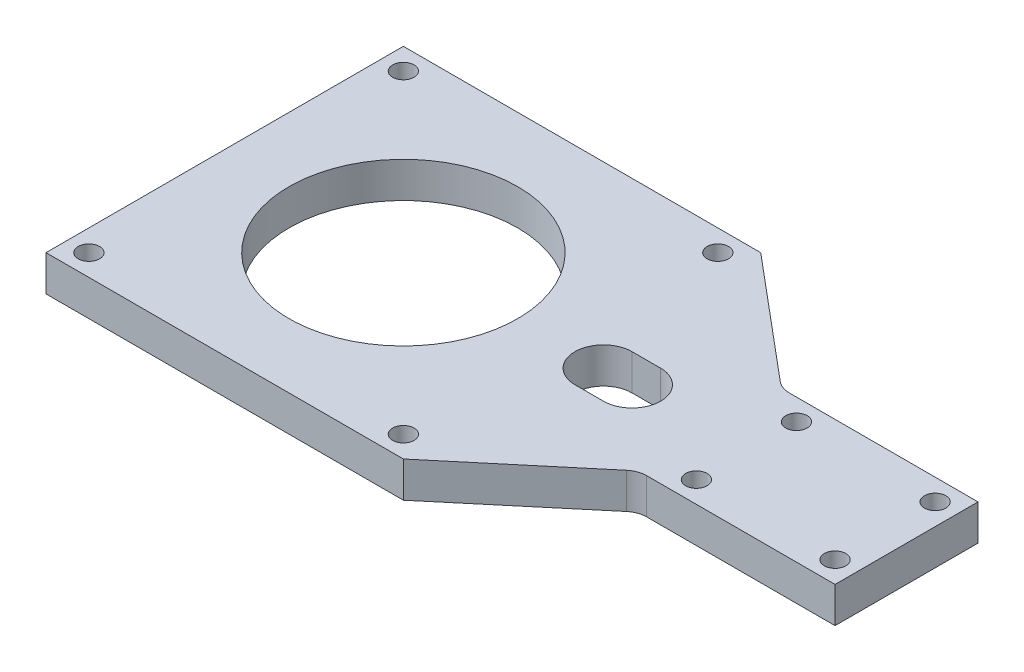
ISO-10303-21;
HEADER;
FILE_DESCRIPTION(('STEP AP214'),'2;1');
FILE_NAME('part.step','',(''),(''),'','','');
FILE_SCHEMA(('AUTOMOTIVE_DESIGN { 1 0 10303 214 1 1 1 1 }'));
ENDSEC;
DATA;
#1=APPLICATION_CONTEXT('core data for automotive mechanical design processes');
#2=APPLICATION_PROTOCOL_DEFINITION('international standard','automotive_design',2000,#1);
#3=PRODUCT_CONTEXT('',#1,'mechanical');
#4=PRODUCT('Part','Part','',(#3));
#5=PRODUCT_RELATED_PRODUCT_CATEGORY('part','',(#4));
#6=PRODUCT_DEFINITION_FORMATION('','',#4);
#7=PRODUCT_DEFINITION_CONTEXT('part definition',#1,'design');
#8=PRODUCT_DEFINITION('design','',#6,#7);
#9=PRODUCT_DEFINITION_SHAPE('','',#8);
#10=(LENGTH_UNIT() NAMED_UNIT(*) SI_UNIT(.MILLI.,.METRE.));
#11=(NAMED_UNIT(*) PLANE_ANGLE_UNIT() SI_UNIT($,.RADIAN.));
#12=(NAMED_UNIT(*) SI_UNIT($,.STERADIAN.) SOLID_ANGLE_UNIT());
#13=UNCERTAINTY_MEASURE_WITH_UNIT(LENGTH_MEASURE(1.E-05),#10,'distance_accuracy_value','');
#14=(GEOMETRIC_REPRESENTATION_CONTEXT(3) GLOBAL_UNCERTAINTY_ASSIGNED_CONTEXT((#13)) GLOBAL_UNIT_ASSIGNED_CONTEXT((#10,
#11,#12)) REPRESENTATION_CONTEXT('',''));
#15=CARTESIAN_POINT('',(0.,0.,0.));
#16=DIRECTION('',(0.,0.,1.));
#17=DIRECTION('',(1.,0.,0.));
#18=AXIS2_PLACEMENT_3D('',#15,#16,#17);
#19=CARTESIAN_POINT('',(15.6554577499628,-35.,0.));
#20=DIRECTION('',(0.,-1.,0.));
#21=DIRECTION('',(1.,0.,0.));
#22=AXIS2_PLACEMENT_3D('',#19,#20,#21);
#23=PLANE('',#22);
#24=CARTESIAN_POINT('',(67.4,-35.,7.));
#25=DIRECTION('',(0.,1.,0.));
#26=DIRECTION('',(0.,0.,1.));
#27=AXIS2_PLACEMENT_3D('',#24,#25,#26);
#28=CIRCLE('',#27,1.5);
#29=CARTESIAN_POINT('',(67.4,-35.,8.5));
#30=VERTEX_POINT('',#29);
#31=EDGE_CURVE('E388',#30,#30,#28,.T.);
#32=ORIENTED_EDGE('',*,*,#31,.F.);
#33=EDGE_LOOP('',(#32));
#34=FACE_BOUND('',#33,.T.);
#35=CARTESIAN_POINT('',(48.,-35.,-7.));
#36=DIRECTION('',(0.,1.,0.));
#37=DIRECTION('',(0.,0.,1.));
#38=AXIS2_PLACEMENT_3D('',#35,#36,#37);
#39=CIRCLE('',#38,1.5);
#40=CARTESIAN_POINT('',(48.,-35.,-5.5));
#41=VERTEX_POINT('',#40);
#42=EDGE_CURVE('E393',#41,#41,#39,.T.);
#43=ORIENTED_EDGE('',*,*,#42,.F.);
#44=EDGE_LOOP('',(#43));
#45=FACE_BOUND('',#44,.T.);
#46=CARTESIAN_POINT('',(67.4,-35.,-7.));
#47=DIRECTION('',(0.,1.,0.));
#48=DIRECTION('',(0.,0.,1.));
#49=AXIS2_PLACEMENT_3D('',#46,#47,#48);
#50=CIRCLE('',#49,1.5);
#51=CARTESIAN_POINT('',(67.4,-35.,-5.5));
#52=VERTEX_POINT('',#51);
#53=EDGE_CURVE('E398',#52,#52,#50,.T.);
#54=ORIENTED_EDGE('',*,*,#53,.F.);
#55=EDGE_LOOP('',(#54));
#56=FACE_BOUND('',#55,.T.);
#57=CARTESIAN_POINT('',(48.,-35.,7.));
#58=DIRECTION('',(0.,1.,0.));
#59=DIRECTION('',(0.,0.,1.));
#60=AXIS2_PLACEMENT_3D('',#57,#58,#59);
#61=CIRCLE('',#60,1.5);
#62=CARTESIAN_POINT('',(48.,-35.,8.5));
#63=VERTEX_POINT('',#62);
#64=EDGE_CURVE('E351',#63,#63,#61,.T.);
#65=ORIENTED_EDGE('',*,*,#64,.F.);
#66=EDGE_LOOP('',(#65));
#67=FACE_BOUND('',#66,.T.);
#68=DIRECTION('',(-1.,0.,0.));
#69=VECTOR('',#68,1.);
#70=CARTESIAN_POINT('',(15.6554577499628,-35.,-4.));
#71=LINE('',#70,#69);
#72=CARTESIAN_POINT('',(32.,-35.,-4.));
#73=VERTEX_POINT('',#72);
#74=CARTESIAN_POINT('',(28.,-35.,-4.));
#75=VERTEX_POINT('',#74);
#76=EDGE_CURVE('E201',#73,#75,#71,.T.);
#77=ORIENTED_EDGE('',*,*,#76,.F.);
#78=CARTESIAN_POINT('',(32.,-35.,0.));
#79=DIRECTION('',(0.,-1.,0.));
#80=DIRECTION('',(0.,0.,-1.));
#81=AXIS2_PLACEMENT_3D('',#78,#79,#80);
#82=CIRCLE('',#81,4.);
#83=CARTESIAN_POINT('',(32.,-35.,4.));
#84=VERTEX_POINT('',#83);
#85=EDGE_CURVE('E161',#84,#73,#82,.F.);
#86=ORIENTED_EDGE('',*,*,#85,.F.);
#87=DIRECTION('',(-1.,0.,0.));
#88=VECTOR('',#87,1.);
#89=CARTESIAN_POINT('',(15.6554577499628,-35.,4.));
#90=LINE('',#89,#88);
#91=CARTESIAN_POINT('',(28.,-35.,4.));
#92=VERTEX_POINT('',#91);
#93=EDGE_CURVE('E195',#84,#92,#90,.T.);
#94=ORIENTED_EDGE('',*,*,#93,.T.);
#95=CARTESIAN_POINT('',(28.,-35.,0.));
#96=DIRECTION('',(0.,-1.,0.));
#97=DIRECTION('',(0.,0.,-1.));
#98=AXIS2_PLACEMENT_3D('',#95,#96,#97);
#99=CIRCLE('',#98,4.);
#100=EDGE_CURVE('E165',#75,#92,#99,.F.);
#101=ORIENTED_EDGE('',*,*,#100,.F.);
#102=EDGE_LOOP('',(#77,#86,#94,#101));
#103=FACE_BOUND('',#102,.T.);
#104=CARTESIAN_POINT('',(22.,-35.,22.));
#105=DIRECTION('',(0.,1.,0.));
#106=DIRECTION('',(0.,0.,-1.));
#107=AXIS2_PLACEMENT_3D('',#104,#105,#106);
#108=CIRCLE('',#107,1.5);
#109=CARTESIAN_POINT('',(22.,-35.,20.5));
#110=VERTEX_POINT('',#109);
#111=EDGE_CURVE('E247',#110,#110,#108,.T.);
#112=ORIENTED_EDGE('',*,*,#111,.F.);
#113=EDGE_LOOP('',(#112));
#114=FACE_BOUND('',#113,.T.);
#115=CARTESIAN_POINT('',(0.,-35.,0.));
#116=DIRECTION('',(0.,-1.,0.));
#117=DIRECTION('',(0.,0.,-1.));
#118=AXIS2_PLACEMENT_3D('',#115,#116,#117);
#119=CIRCLE('',#118,16.);
#120=CARTESIAN_POINT('',(0.,-35.,-16.));
#121=VERTEX_POINT('',#120);
#122=EDGE_CURVE('E251',#121,#121,#119,.T.);
#123=ORIENTED_EDGE('',*,*,#122,.T.);
#124=EDGE_LOOP('',(#123));
#125=FACE_BOUND('',#124,.T.);
#126=CARTESIAN_POINT('',(22.,-35.,-22.));
#127=DIRECTION('',(0.,-1.,0.));
#128=DIRECTION('',(0.,0.,-1.));
#129=AXIS2_PLACEMENT_3D('',#126,#127,#128);
#130=CIRCLE('',#129,1.5);
#131=CARTESIAN_POINT('',(22.,-35.,-23.5));
#132=VERTEX_POINT('',#131);
#133=EDGE_CURVE('E256',#132,#132,#130,.T.);
#134=ORIENTED_EDGE('',*,*,#133,.T.);
#135=EDGE_LOOP('',(#134));
#136=FACE_BOUND('',#135,.T.);
#137=CARTESIAN_POINT('',(-22.,-35.,-22.));
#138=DIRECTION('',(0.,1.,0.));
#139=DIRECTION('',(0.,0.,-1.));
#140=AXIS2_PLACEMENT_3D('',#137,#138,#139);
#141=CIRCLE('',#140,1.5);
#142=CARTESIAN_POINT('',(-22.,-35.,-23.5));
#143=VERTEX_POINT('',#142);
#144=EDGE_CURVE('E260',#143,#143,#141,.T.);
#145=ORIENTED_EDGE('',*,*,#144,.F.);
#146=EDGE_LOOP('',(#145));
#147=FACE_BOUND('',#146,.T.);
#148=CARTESIAN_POINT('',(-22.,-35.,22.));
#149=DIRECTION('',(0.,-1.,0.));
#150=DIRECTION('',(0.,0.,-1.));
#151=AXIS2_PLACEMENT_3D('',#148,#149,#150);
#152=CIRCLE('',#151,1.5);
#153=CARTESIAN_POINT('',(-22.,-35.,20.5));
#154=VERTEX_POINT('',#153);
#155=EDGE_CURVE('E264',#154,#154,#152,.T.);
#156=ORIENTED_EDGE('',*,*,#155,.T.);
#157=EDGE_LOOP('',(#156));
#158=FACE_BOUND('',#157,.T.);
#159=DIRECTION('',(-1.,0.,0.));
#160=VECTOR('',#159,1.);
#161=CARTESIAN_POINT('',(0.,-35.,25.));
#162=LINE('',#161,#160);
#163=CARTESIAN_POINT('',(25.,-35.,25.));
#164=VERTEX_POINT('',#163);
#165=CARTESIAN_POINT('',(-25.,-35.,25.));
#166=VERTEX_POINT('',#165);
#167=EDGE_CURVE('E268',#164,#166,#162,.T.);
#168=ORIENTED_EDGE('',*,*,#167,.F.);
#169=DIRECTION('',(-0.766044443118978,0.,0.642787609686539));
#170=VECTOR('',#169,1.);
#171=CARTESIAN_POINT('',(33.9381519444566,-35.,17.5));
#172=LINE('',#171,#170);
#173=CARTESIAN_POINT('',(41.9910587219536,-35.,10.7428088930972));
#174=VERTEX_POINT('',#173);
#175=EDGE_CURVE('E243',#174,#164,#172,.T.);
#176=ORIENTED_EDGE('',*,*,#175,.F.);
#177=CARTESIAN_POINT('',(44.0319093827083,-35.,13.175));
#178=DIRECTION('',(0.,-1.,0.));
#179=DIRECTION('',(0.,0.,-1.));
#180=AXIS2_PLACEMENT_3D('',#177,#178,#179);
#181=CIRCLE('',#180,3.175);
#182=CARTESIAN_POINT('',(44.0319093827083,-35.,10.));
#183=VERTEX_POINT('',#182);
#184=EDGE_CURVE('E11',#174,#183,#181,.T.);
#185=ORIENTED_EDGE('',*,*,#184,.T.);
#186=DIRECTION('',(-1.,0.,0.));
#187=VECTOR('',#186,1.);
#188=CARTESIAN_POINT('',(56.6381519444566,-35.,10.));
#189=LINE('',#188,#187);
#190=CARTESIAN_POINT('',(70.4,-35.,10.));
#191=VERTEX_POINT('',#190);
#192=EDGE_CURVE('E229',#191,#183,#189,.T.);
#193=ORIENTED_EDGE('',*,*,#192,.F.);
#194=DIRECTION('',(0.,0.,1.));
#195=VECTOR('',#194,1.);
#196=CARTESIAN_POINT('',(70.4,-35.,0.));
#197=LINE('',#196,#195);
#198=CARTESIAN_POINT('',(70.4,-35.,-10.));
#199=VERTEX_POINT('',#198);
#200=EDGE_CURVE('E233',#199,#191,#197,.T.);
#201=ORIENTED_EDGE('',*,*,#200,.F.);
#202=DIRECTION('',(1.,0.,0.));
#203=VECTOR('',#202,1.);
#204=CARTESIAN_POINT('',(56.6381519444566,-35.,-10.));
#205=LINE('',#204,#203);
#206=CARTESIAN_POINT('',(44.0319093827083,-35.,-10.));
#207=VERTEX_POINT('',#206);
#208=EDGE_CURVE('E236',#207,#199,#205,.T.);
#209=ORIENTED_EDGE('',*,*,#208,.F.);
#210=CARTESIAN_POINT('',(44.0319093827083,-35.,-13.175));
#211=DIRECTION('',(0.,-1.,0.));
#212=DIRECTION('',(0.,0.,-1.));
#213=AXIS2_PLACEMENT_3D('',#210,#211,#212);
#214=CIRCLE('',#213,3.175);
#215=CARTESIAN_POINT('',(41.9910587219536,-35.,-10.7428088930972));
#216=VERTEX_POINT('',#215);
#217=EDGE_CURVE('E341',#207,#216,#214,.T.);
#218=ORIENTED_EDGE('',*,*,#217,.T.);
#219=DIRECTION('',(0.766044443118978,0.,0.642787609686539));
#220=VECTOR('',#219,1.);
#221=CARTESIAN_POINT('',(33.9381519444566,-35.,-17.5));
#222=LINE('',#221,#220);
#223=CARTESIAN_POINT('',(25.,-35.,-25.));
#224=VERTEX_POINT('',#223);
#225=EDGE_CURVE('E239',#224,#216,#222,.T.);
#226=ORIENTED_EDGE('',*,*,#225,.F.);
#227=DIRECTION('',(-1.,0.,0.));
#228=VECTOR('',#227,1.);
#229=CARTESIAN_POINT('',(0.,-35.,-25.));
#230=LINE('',#229,#228);
#231=CARTESIAN_POINT('',(-25.,-35.,-25.));
#232=VERTEX_POINT('',#231);
#233=EDGE_CURVE('E276',#224,#232,#230,.T.);
#234=ORIENTED_EDGE('',*,*,#233,.T.);
#235=DIRECTION('',(0.,0.,-1.));
#236=VECTOR('',#235,1.);
#237=CARTESIAN_POINT('',(-25.,-35.,0.));
#238=LINE('',#237,#236);
#239=EDGE_CURVE('E272',#166,#232,#238,.T.);
#240=ORIENTED_EDGE('',*,*,#239,.F.);
#241=EDGE_LOOP('',(#168,#176,#185,#193,#201,#209,#218,#226,#234,#240));
#242=FACE_BOUND('',#241,.T.);
#243=ADVANCED_FACE('F17',(#34,#45,#56,#67,#103,#114,#125,#136,#147,#158,#242),#23,.F.);
#244=CARTESIAN_POINT('',(15.6554577499628,-40.,0.));
#245=DIRECTION('',(0.,-1.,0.));
#246=DIRECTION('',(1.,0.,0.));
#247=AXIS2_PLACEMENT_3D('',#244,#245,#246);
#248=PLANE('',#247);
#249=CARTESIAN_POINT('',(67.4,-40.,7.));
#250=DIRECTION('',(0.,-1.,0.));
#251=DIRECTION('',(0.,0.,-1.));
#252=AXIS2_PLACEMENT_3D('',#249,#250,#251);
#253=CIRCLE('',#252,1.5);
#254=CARTESIAN_POINT('',(67.4,-40.,5.5));
#255=VERTEX_POINT('',#254);
#256=EDGE_CURVE('E21',#255,#255,#253,.T.);
#257=ORIENTED_EDGE('',*,*,#256,.F.);
#258=EDGE_LOOP('',(#257));
#259=FACE_BOUND('',#258,.T.);
#260=CARTESIAN_POINT('',(48.,-40.,-7.));
#261=DIRECTION('',(0.,-1.,0.));
#262=DIRECTION('',(0.,0.,-1.));
#263=AXIS2_PLACEMENT_3D('',#260,#261,#262);
#264=CIRCLE('',#263,1.5);
#265=CARTESIAN_POINT('',(48.,-40.,-8.5));
#266=VERTEX_POINT('',#265);
#267=EDGE_CURVE('E354',#266,#266,#264,.T.);
#268=ORIENTED_EDGE('',*,*,#267,.F.);
#269=EDGE_LOOP('',(#268));
#270=FACE_BOUND('',#269,.T.);
#271=CARTESIAN_POINT('',(67.4,-40.,-7.));
#272=DIRECTION('',(0.,-1.,0.));
#273=DIRECTION('',(0.,0.,-1.));
#274=AXIS2_PLACEMENT_3D('',#271,#272,#273);
#275=CIRCLE('',#274,1.5);
#276=CARTESIAN_POINT('',(67.4,-40.,-8.5));
#277=VERTEX_POINT('',#276);
#278=EDGE_CURVE('E350',#277,#277,#275,.T.);
#279=ORIENTED_EDGE('',*,*,#278,.F.);
#280=EDGE_LOOP('',(#279));
#281=FACE_BOUND('',#280,.T.);
#282=CARTESIAN_POINT('',(48.,-40.,7.));
#283=DIRECTION('',(0.,-1.,0.));
#284=DIRECTION('',(0.,0.,-1.));
#285=AXIS2_PLACEMENT_3D('',#282,#283,#284);
#286=CIRCLE('',#285,1.5);
#287=CARTESIAN_POINT('',(48.,-40.,5.5));
#288=VERTEX_POINT('',#287);
#289=EDGE_CURVE('E346',#288,#288,#286,.T.);
#290=ORIENTED_EDGE('',*,*,#289,.F.);
#291=EDGE_LOOP('',(#290));
#292=FACE_BOUND('',#291,.T.);
#293=CARTESIAN_POINT('',(32.,-40.,0.));
#294=DIRECTION('',(0.,1.,0.));
#295=DIRECTION('',(0.,0.,-1.));
#296=AXIS2_PLACEMENT_3D('',#293,#294,#295);
#297=CIRCLE('',#296,4.);
#298=CARTESIAN_POINT('',(32.,-40.,4.));
#299=VERTEX_POINT('',#298);
#300=CARTESIAN_POINT('',(32.,-40.,-4.));
#301=VERTEX_POINT('',#300);
#302=EDGE_CURVE('E159',#299,#301,#297,.T.);
#303=ORIENTED_EDGE('',*,*,#302,.T.);
#304=DIRECTION('',(-1.,0.,0.));
#305=VECTOR('',#304,1.);
#306=CARTESIAN_POINT('',(30.,-40.,-4.));
#307=LINE('',#306,#305);
#308=CARTESIAN_POINT('',(28.,-40.,-4.));
#309=VERTEX_POINT('',#308);
#310=EDGE_CURVE('E169',#301,#309,#307,.T.);
#311=ORIENTED_EDGE('',*,*,#310,.T.);
#312=CARTESIAN_POINT('',(28.,-40.,0.));
#313=DIRECTION('',(0.,1.,0.));
#314=DIRECTION('',(0.,0.,-1.));
#315=AXIS2_PLACEMENT_3D('',#312,#313,#314);
#316=CIRCLE('',#315,4.);
#317=CARTESIAN_POINT('',(28.,-40.,4.));
#318=VERTEX_POINT('',#317);
#319=EDGE_CURVE('E183',#309,#318,#316,.T.);
#320=ORIENTED_EDGE('',*,*,#319,.T.);
#321=DIRECTION('',(-1.,0.,0.));
#322=VECTOR('',#321,1.);
#323=CARTESIAN_POINT('',(30.,-40.,4.));
#324=LINE('',#323,#322);
#325=EDGE_CURVE('E52',#299,#318,#324,.T.);
#326=ORIENTED_EDGE('',*,*,#325,.F.);
#327=EDGE_LOOP('',(#303,#311,#320,#326));
#328=FACE_BOUND('',#327,.T.);
#329=CARTESIAN_POINT('',(22.,-40.,22.));
#330=DIRECTION('',(0.,1.,0.));
#331=DIRECTION('',(0.,0.,-1.));
#332=AXIS2_PLACEMENT_3D('',#329,#330,#331);
#333=CIRCLE('',#332,1.5);
#334=CARTESIAN_POINT('',(22.,-40.,20.5));
#335=VERTEX_POINT('',#334);
#336=EDGE_CURVE('E246',#335,#335,#333,.T.);
#337=ORIENTED_EDGE('',*,*,#336,.T.);
#338=EDGE_LOOP('',(#337));
#339=FACE_BOUND('',#338,.T.);
#340=CARTESIAN_POINT('',(0.,-40.,0.));
#341=DIRECTION('',(0.,-1.,0.));
#342=DIRECTION('',(0.,0.,-1.));
#343=AXIS2_PLACEMENT_3D('',#340,#341,#342);
#344=CIRCLE('',#343,16.);
#345=CARTESIAN_POINT('',(0.,-40.,-16.));
#346=VERTEX_POINT('',#345);
#347=EDGE_CURVE('E284',#346,#346,#344,.T.);
#348=ORIENTED_EDGE('',*,*,#347,.F.);
#349=EDGE_LOOP('',(#348));
#350=FACE_BOUND('',#349,.T.);
#351=CARTESIAN_POINT('',(22.,-40.,-22.));
#352=DIRECTION('',(0.,-1.,0.));
#353=DIRECTION('',(0.,0.,-1.));
#354=AXIS2_PLACEMENT_3D('',#351,#352,#353);
#355=CIRCLE('',#354,1.5);
#356=CARTESIAN_POINT('',(22.,-40.,-23.5));
#357=VERTEX_POINT('',#356);
#358=EDGE_CURVE('E288',#357,#357,#355,.T.);
#359=ORIENTED_EDGE('',*,*,#358,.F.);
#360=EDGE_LOOP('',(#359));
#361=FACE_BOUND('',#360,.T.);
#362=CARTESIAN_POINT('',(-22.,-40.,-22.));
#363=DIRECTION('',(0.,1.,0.));
#364=DIRECTION('',(0.,0.,-1.));
#365=AXIS2_PLACEMENT_3D('',#362,#363,#364);
#366=CIRCLE('',#365,1.5);
#367=CARTESIAN_POINT('',(-22.,-40.,-23.5));
#368=VERTEX_POINT('',#367);
#369=EDGE_CURVE('E292',#368,#368,#366,.T.);
#370=ORIENTED_EDGE('',*,*,#369,.T.);
#371=EDGE_LOOP('',(#370));
#372=FACE_BOUND('',#371,.T.);
#373=CARTESIAN_POINT('',(-22.,-40.,22.));
#374=DIRECTION('',(0.,-1.,0.));
#375=DIRECTION('',(0.,0.,-1.));
#376=AXIS2_PLACEMENT_3D('',#373,#374,#375);
#377=CIRCLE('',#376,1.5);
#378=CARTESIAN_POINT('',(-22.,-40.,20.5));
#379=VERTEX_POINT('',#378);
#380=EDGE_CURVE('E296',#379,#379,#377,.T.);
#381=ORIENTED_EDGE('',*,*,#380,.F.);
#382=EDGE_LOOP('',(#381));
#383=FACE_BOUND('',#382,.T.);
#384=DIRECTION('',(-1.,0.,0.));
#385=VECTOR('',#384,1.);
#386=CARTESIAN_POINT('',(0.,-40.,-25.));
#387=LINE('',#386,#385);
#388=CARTESIAN_POINT('',(25.,-40.,-25.));
#389=VERTEX_POINT('',#388);
#390=CARTESIAN_POINT('',(-25.,-40.,-25.));
#391=VERTEX_POINT('',#390);
#392=EDGE_CURVE('E252',#389,#391,#387,.T.);
#393=ORIENTED_EDGE('',*,*,#392,.F.);
#394=DIRECTION('',(-0.766044443118978,0.,-0.642787609686539));
#395=VECTOR('',#394,1.);
#396=CARTESIAN_POINT('',(33.9381519444566,-40.,-17.5));
#397=LINE('',#396,#395);
#398=CARTESIAN_POINT('',(41.9910587219536,-40.,-10.7428088930972));
#399=VERTEX_POINT('',#398);
#400=EDGE_CURVE('E208',#399,#389,#397,.T.);
#401=ORIENTED_EDGE('',*,*,#400,.F.);
#402=CARTESIAN_POINT('',(44.0319093827083,-40.,-13.175));
#403=DIRECTION('',(0.,-1.,0.));
#404=DIRECTION('',(0.,0.,-1.));
#405=AXIS2_PLACEMENT_3D('',#402,#403,#404);
#406=CIRCLE('',#405,3.175);
#407=CARTESIAN_POINT('',(44.0319093827083,-40.,-10.));
#408=VERTEX_POINT('',#407);
#409=EDGE_CURVE('E338',#399,#408,#406,.F.);
#410=ORIENTED_EDGE('',*,*,#409,.T.);
#411=DIRECTION('',(-1.,0.,0.));
#412=VECTOR('',#411,1.);
#413=CARTESIAN_POINT('',(56.6381519444566,-40.,-10.));
#414=LINE('',#413,#412);
#415=CARTESIAN_POINT('',(70.4,-40.,-10.));
#416=VERTEX_POINT('',#415);
#417=EDGE_CURVE('E211',#416,#408,#414,.T.);
#418=ORIENTED_EDGE('',*,*,#417,.F.);
#419=DIRECTION('',(0.,0.,-1.));
#420=VECTOR('',#419,1.);
#421=CARTESIAN_POINT('',(70.4,-40.,0.));
#422=LINE('',#421,#420);
#423=CARTESIAN_POINT('',(70.4,-40.,10.));
#424=VERTEX_POINT('',#423);
#425=EDGE_CURVE('E215',#424,#416,#422,.T.);
#426=ORIENTED_EDGE('',*,*,#425,.F.);
#427=DIRECTION('',(1.,0.,0.));
#428=VECTOR('',#427,1.);
#429=CARTESIAN_POINT('',(56.6381519444566,-40.,10.));
#430=LINE('',#429,#428);
#431=CARTESIAN_POINT('',(44.0319093827083,-40.,10.));
#432=VERTEX_POINT('',#431);
#433=EDGE_CURVE('E219',#432,#424,#430,.T.);
#434=ORIENTED_EDGE('',*,*,#433,.F.);
#435=CARTESIAN_POINT('',(44.0319093827083,-40.,13.175));
#436=DIRECTION('',(0.,-1.,0.));
#437=DIRECTION('',(0.,0.,-1.));
#438=AXIS2_PLACEMENT_3D('',#435,#436,#437);
#439=CIRCLE('',#438,3.175);
#440=CARTESIAN_POINT('',(41.9910587219536,-40.,10.7428088930972));
#441=VERTEX_POINT('',#440);
#442=EDGE_CURVE('E27',#432,#441,#439,.F.);
#443=ORIENTED_EDGE('',*,*,#442,.T.);
#444=DIRECTION('',(0.766044443118978,0.,-0.642787609686539));
#445=VECTOR('',#444,1.);
#446=CARTESIAN_POINT('',(33.9381519444566,-40.,17.5));
#447=LINE('',#446,#445);
#448=CARTESIAN_POINT('',(25.,-40.,25.));
#449=VERTEX_POINT('',#448);
#450=EDGE_CURVE('E204',#449,#441,#447,.T.);
#451=ORIENTED_EDGE('',*,*,#450,.F.);
#452=DIRECTION('',(-1.,0.,0.));
#453=VECTOR('',#452,1.);
#454=CARTESIAN_POINT('',(0.,-40.,25.));
#455=LINE('',#454,#453);
#456=CARTESIAN_POINT('',(-25.,-40.,25.));
#457=VERTEX_POINT('',#456);
#458=EDGE_CURVE('E300',#449,#457,#455,.T.);
#459=ORIENTED_EDGE('',*,*,#458,.T.);
#460=DIRECTION('',(0.,0.,-1.));
#461=VECTOR('',#460,1.);
#462=CARTESIAN_POINT('',(-25.,-40.,0.));
#463=LINE('',#462,#461);
#464=EDGE_CURVE('E304',#457,#391,#463,.T.);
#465=ORIENTED_EDGE('',*,*,#464,.T.);
#466=EDGE_LOOP('',(#393,#401,#410,#418,#426,#434,#443,#451,#459,#465));
#467=FACE_BOUND('',#466,.T.);
#468=ADVANCED_FACE('F175',(#259,#270,#281,#292,#328,#339,#350,#361,#372,#383,#467),#248,.T.);
#469=CARTESIAN_POINT('',(0.,-35.,25.));
#470=DIRECTION('',(0.,0.,1.));
#471=DIRECTION('',(1.,0.,0.));
#472=AXIS2_PLACEMENT_3D('',#469,#470,#471);
#473=PLANE('',#472);
#474=ORIENTED_EDGE('',*,*,#458,.F.);
#475=DIRECTION('',(0.,-1.,0.));
#476=VECTOR('',#475,1.);
#477=CARTESIAN_POINT('',(25.,-35.,25.));
#478=LINE('',#477,#476);
#479=EDGE_CURVE('E320',#164,#449,#478,.T.);
#480=ORIENTED_EDGE('',*,*,#479,.F.);
#481=ORIENTED_EDGE('',*,*,#167,.T.);
#482=DIRECTION('',(0.,-1.,0.));
#483=VECTOR('',#482,1.);
#484=CARTESIAN_POINT('',(-25.,-35.,25.));
#485=LINE('',#484,#483);
#486=EDGE_CURVE('E317',#166,#457,#485,.T.);
#487=ORIENTED_EDGE('',*,*,#486,.T.);
#488=EDGE_LOOP('',(#474,#480,#481,#487));
#489=FACE_BOUND('',#488,.T.);
#490=ADVANCED_FACE('F371',(#489),#473,.T.);
#491=CARTESIAN_POINT('',(-25.,-35.,0.));
#492=DIRECTION('',(-1.,0.,0.));
#493=DIRECTION('',(0.,0.,1.));
#494=AXIS2_PLACEMENT_3D('',#491,#492,#493);
#495=PLANE('',#494);
#496=ORIENTED_EDGE('',*,*,#464,.F.);
#497=ORIENTED_EDGE('',*,*,#486,.F.);
#498=ORIENTED_EDGE('',*,*,#239,.T.);
#499=DIRECTION('',(0.,-1.,0.));
#500=VECTOR('',#499,1.);
#501=CARTESIAN_POINT('',(-25.,-35.,-25.));
#502=LINE('',#501,#500);
#503=EDGE_CURVE('E314',#232,#391,#502,.T.);
#504=ORIENTED_EDGE('',*,*,#503,.T.);
#505=EDGE_LOOP('',(#496,#497,#498,#504));
#506=FACE_BOUND('',#505,.T.);
#507=ADVANCED_FACE('F463',(#506),#495,.T.);
#508=CARTESIAN_POINT('',(-22.,-35.,22.));
#509=DIRECTION('',(0.,-1.,0.));
#510=DIRECTION('',(0.,0.,-1.));
#511=AXIS2_PLACEMENT_3D('',#508,#509,#510);
#512=CYLINDRICAL_SURFACE('',#511,1.5);
#513=ORIENTED_EDGE('',*,*,#155,.F.);
#514=EDGE_LOOP('',(#513));
#515=FACE_BOUND('',#514,.T.);
#516=ORIENTED_EDGE('',*,*,#380,.T.);
#517=EDGE_LOOP('',(#516));
#518=FACE_BOUND('',#517,.T.);
#519=ADVANCED_FACE('F465',(#515,#518),#512,.F.);
#520=CARTESIAN_POINT('',(-22.,-35.,-22.));
#521=DIRECTION('',(0.,-1.,0.));
#522=DIRECTION('',(0.,0.,-1.));
#523=AXIS2_PLACEMENT_3D('',#520,#521,#522);
#524=CYLINDRICAL_SURFACE('',#523,1.5);
#525=ORIENTED_EDGE('',*,*,#144,.T.);
#526=EDGE_LOOP('',(#525));
#527=FACE_BOUND('',#526,.T.);
#528=ORIENTED_EDGE('',*,*,#369,.F.);
#529=EDGE_LOOP('',(#528));
#530=FACE_BOUND('',#529,.T.);
#531=ADVANCED_FACE('F472',(#527,#530),#524,.F.);
#532=CARTESIAN_POINT('',(22.,-35.,-22.));
#533=DIRECTION('',(0.,-1.,0.));
#534=DIRECTION('',(0.,0.,-1.));
#535=AXIS2_PLACEMENT_3D('',#532,#533,#534);
#536=CYLINDRICAL_SURFACE('',#535,1.5);
#537=ORIENTED_EDGE('',*,*,#133,.F.);
#538=EDGE_LOOP('',(#537));
#539=FACE_BOUND('',#538,.T.);
#540=ORIENTED_EDGE('',*,*,#358,.T.);
#541=EDGE_LOOP('',(#540));
#542=FACE_BOUND('',#541,.T.);
#543=ADVANCED_FACE('F480',(#539,#542),#536,.F.);
#544=CARTESIAN_POINT('',(0.,-35.,0.));
#545=DIRECTION('',(0.,-1.,0.));
#546=DIRECTION('',(0.,0.,-1.));
#547=AXIS2_PLACEMENT_3D('',#544,#545,#546);
#548=CYLINDRICAL_SURFACE('',#547,16.);
#549=ORIENTED_EDGE('',*,*,#122,.F.);
#550=EDGE_LOOP('',(#549));
#551=FACE_BOUND('',#550,.T.);
#552=ORIENTED_EDGE('',*,*,#347,.T.);
#553=EDGE_LOOP('',(#552));
#554=FACE_BOUND('',#553,.T.);
#555=ADVANCED_FACE('F484',(#551,#554),#548,.F.);
#556=CARTESIAN_POINT('',(22.,-35.,22.));
#557=DIRECTION('',(0.,-1.,0.));
#558=DIRECTION('',(0.,0.,-1.));
#559=AXIS2_PLACEMENT_3D('',#556,#557,#558);
#560=CYLINDRICAL_SURFACE('',#559,1.5);
#561=ORIENTED_EDGE('',*,*,#111,.T.);
#562=EDGE_LOOP('',(#561));
#563=FACE_BOUND('',#562,.T.);
#564=ORIENTED_EDGE('',*,*,#336,.F.);
#565=EDGE_LOOP('',(#564));
#566=FACE_BOUND('',#565,.T.);
#567=ADVANCED_FACE('F488',(#563,#566),#560,.F.);
#568=CARTESIAN_POINT('',(0.,-35.,-25.));
#569=DIRECTION('',(0.,0.,1.));
#570=DIRECTION('',(1.,0.,0.));
#571=AXIS2_PLACEMENT_3D('',#568,#569,#570);
#572=PLANE('',#571);
#573=ORIENTED_EDGE('',*,*,#392,.T.);
#574=ORIENTED_EDGE('',*,*,#503,.F.);
#575=ORIENTED_EDGE('',*,*,#233,.F.);
#576=DIRECTION('',(0.,-1.,0.));
#577=VECTOR('',#576,1.);
#578=CARTESIAN_POINT('',(25.,-35.,-25.));
#579=LINE('',#578,#577);
#580=EDGE_CURVE('E280',#224,#389,#579,.T.);
#581=ORIENTED_EDGE('',*,*,#580,.T.);
#582=EDGE_LOOP('',(#573,#574,#575,#581));
#583=FACE_BOUND('',#582,.T.);
#584=ADVANCED_FACE('F461',(#583),#572,.F.);
#585=CARTESIAN_POINT('',(33.9381519444566,-34.998,-17.5));
#586=DIRECTION('',(-0.642787609686539,0.,0.766044443118978));
#587=DIRECTION('',(0.766044443118978,0.,0.642787609686539));
#588=AXIS2_PLACEMENT_3D('',#585,#586,#587);
#589=PLANE('',#588);
#590=ORIENTED_EDGE('',*,*,#225,.T.);
#591=DIRECTION('',(0.,-1.,0.));
#592=VECTOR('',#591,1.);
#593=CARTESIAN_POINT('',(41.9910587219536,-40.,-10.7428088930972));
#594=LINE('',#593,#592);
#595=EDGE_CURVE('E324',#216,#399,#594,.T.);
#596=ORIENTED_EDGE('',*,*,#595,.T.);
#597=ORIENTED_EDGE('',*,*,#400,.T.);
#598=ORIENTED_EDGE('',*,*,#580,.F.);
#599=EDGE_LOOP('',(#590,#596,#597,#598));
#600=FACE_BOUND('',#599,.T.);
#601=ADVANCED_FACE('F458',(#600),#589,.F.);
#602=CARTESIAN_POINT('',(56.6381519444566,-34.998,-10.));
#603=DIRECTION('',(0.,0.,1.));
#604=DIRECTION('',(1.,0.,0.));
#605=AXIS2_PLACEMENT_3D('',#602,#603,#604);
#606=PLANE('',#605);
#607=ORIENTED_EDGE('',*,*,#417,.T.);
#608=DIRECTION('',(0.,-1.,0.));
#609=VECTOR('',#608,1.);
#610=CARTESIAN_POINT('',(44.0319093827083,-35.,-10.));
#611=LINE('',#610,#609);
#612=EDGE_CURVE('E328',#408,#207,#611,.F.);
#613=ORIENTED_EDGE('',*,*,#612,.T.);
#614=ORIENTED_EDGE('',*,*,#208,.T.);
#615=DIRECTION('',(0.,-1.,0.));
#616=VECTOR('',#615,1.);
#617=CARTESIAN_POINT('',(70.4,-34.998,-10.));
#618=LINE('',#617,#616);
#619=EDGE_CURVE('E226',#199,#416,#618,.T.);
#620=ORIENTED_EDGE('',*,*,#619,.T.);
#621=EDGE_LOOP('',(#607,#613,#614,#620));
#622=FACE_BOUND('',#621,.T.);
#623=ADVANCED_FACE('F450',(#622),#606,.F.);
#624=CARTESIAN_POINT('',(33.9381519444566,-34.998,17.5));
#625=DIRECTION('',(-0.642787609686539,0.,-0.766044443118978));
#626=DIRECTION('',(-0.766044443118978,0.,0.642787609686539));
#627=AXIS2_PLACEMENT_3D('',#624,#625,#626);
#628=PLANE('',#627);
#629=ORIENTED_EDGE('',*,*,#450,.T.);
#630=DIRECTION('',(0.,-1.,0.));
#631=VECTOR('',#630,1.);
#632=CARTESIAN_POINT('',(41.9910587219536,-35.,10.7428088930972));
#633=LINE('',#632,#631);
#634=EDGE_CURVE('E335',#441,#174,#633,.F.);
#635=ORIENTED_EDGE('',*,*,#634,.T.);
#636=ORIENTED_EDGE('',*,*,#175,.T.);
#637=ORIENTED_EDGE('',*,*,#479,.T.);
#638=EDGE_LOOP('',(#629,#635,#636,#637));
#639=FACE_BOUND('',#638,.T.);
#640=ADVANCED_FACE('F430',(#639),#628,.F.);
#641=CARTESIAN_POINT('',(70.4,-34.998,0.));
#642=DIRECTION('',(-1.,0.,0.));
#643=DIRECTION('',(0.,0.,1.));
#644=AXIS2_PLACEMENT_3D('',#641,#642,#643);
#645=PLANE('',#644);
#646=ORIENTED_EDGE('',*,*,#619,.F.);
#647=ORIENTED_EDGE('',*,*,#200,.T.);
#648=DIRECTION('',(0.,-1.,0.));
#649=VECTOR('',#648,1.);
#650=CARTESIAN_POINT('',(70.4,-34.998,10.));
#651=LINE('',#650,#649);
#652=EDGE_CURVE('E222',#191,#424,#651,.T.);
#653=ORIENTED_EDGE('',*,*,#652,.T.);
#654=ORIENTED_EDGE('',*,*,#425,.T.);
#655=EDGE_LOOP('',(#646,#647,#653,#654));
#656=FACE_BOUND('',#655,.T.);
#657=ADVANCED_FACE('F447',(#656),#645,.F.);
#658=CARTESIAN_POINT('',(56.6381519444566,-34.998,10.));
#659=DIRECTION('',(0.,0.,-1.));
#660=DIRECTION('',(-1.,0.,0.));
#661=AXIS2_PLACEMENT_3D('',#658,#659,#660);
#662=PLANE('',#661);
#663=ORIENTED_EDGE('',*,*,#192,.T.);
#664=DIRECTION('',(0.,-1.,0.));
#665=VECTOR('',#664,1.);
#666=CARTESIAN_POINT('',(44.0319093827083,-40.,10.));
#667=LINE('',#666,#665);
#668=EDGE_CURVE('E331',#183,#432,#667,.T.);
#669=ORIENTED_EDGE('',*,*,#668,.T.);
#670=ORIENTED_EDGE('',*,*,#433,.T.);
#671=ORIENTED_EDGE('',*,*,#652,.F.);
#672=EDGE_LOOP('',(#663,#669,#670,#671));
#673=FACE_BOUND('',#672,.T.);
#674=ADVANCED_FACE('F439',(#673),#662,.F.);
#675=CARTESIAN_POINT('',(44.0319093827083,-34.998,-13.175));
#676=DIRECTION('',(0.,1.,0.));
#677=DIRECTION('',(0.,0.,1.));
#678=AXIS2_PLACEMENT_3D('',#675,#676,#677);
#679=CYLINDRICAL_SURFACE('',#678,3.175);
#680=ORIENTED_EDGE('',*,*,#217,.F.);
#681=ORIENTED_EDGE('',*,*,#612,.F.);
#682=ORIENTED_EDGE('',*,*,#409,.F.);
#683=ORIENTED_EDGE('',*,*,#595,.F.);
#684=EDGE_LOOP('',(#680,#681,#682,#683));
#685=FACE_BOUND('',#684,.T.);
#686=ADVANCED_FACE('F453',(#685),#679,.F.);
#687=CARTESIAN_POINT('',(44.0319093827083,-34.998,13.175));
#688=DIRECTION('',(0.,1.,0.));
#689=DIRECTION('',(0.,0.,1.));
#690=AXIS2_PLACEMENT_3D('',#687,#688,#689);
#691=CYLINDRICAL_SURFACE('',#690,3.175);
#692=ORIENTED_EDGE('',*,*,#184,.F.);
#693=ORIENTED_EDGE('',*,*,#634,.F.);
#694=ORIENTED_EDGE('',*,*,#442,.F.);
#695=ORIENTED_EDGE('',*,*,#668,.F.);
#696=EDGE_LOOP('',(#692,#693,#694,#695));
#697=FACE_BOUND('',#696,.T.);
#698=ADVANCED_FACE('F19',(#697),#691,.F.);
#699=CARTESIAN_POINT('',(30.,109.874007740351,-4.));
#700=DIRECTION('',(0.,0.,1.));
#701=DIRECTION('',(1.,0.,0.));
#702=AXIS2_PLACEMENT_3D('',#699,#700,#701);
#703=PLANE('',#702);
#704=ORIENTED_EDGE('',*,*,#76,.T.);
#705=DIRECTION('',(0.,-1.,0.));
#706=VECTOR('',#705,1.);
#707=CARTESIAN_POINT('',(28.,109.874007740351,-4.));
#708=LINE('',#707,#706);
#709=EDGE_CURVE('E40',#75,#309,#708,.T.);
#710=ORIENTED_EDGE('',*,*,#709,.T.);
#711=ORIENTED_EDGE('',*,*,#310,.F.);
#712=DIRECTION('',(0.,-1.,0.));
#713=VECTOR('',#712,1.);
#714=CARTESIAN_POINT('',(32.,109.874007740351,-4.));
#715=LINE('',#714,#713);
#716=EDGE_CURVE('E154',#73,#301,#715,.T.);
#717=ORIENTED_EDGE('',*,*,#716,.F.);
#718=EDGE_LOOP('',(#704,#710,#711,#717));
#719=FACE_BOUND('',#718,.T.);
#720=ADVANCED_FACE('F170',(#719),#703,.T.);
#721=CARTESIAN_POINT('',(32.,109.874007740351,0.));
#722=DIRECTION('',(0.,-1.,0.));
#723=DIRECTION('',(0.,0.,-1.));
#724=AXIS2_PLACEMENT_3D('',#721,#722,#723);
#725=CYLINDRICAL_SURFACE('',#724,4.);
#726=ORIENTED_EDGE('',*,*,#85,.T.);
#727=ORIENTED_EDGE('',*,*,#716,.T.);
#728=ORIENTED_EDGE('',*,*,#302,.F.);
#729=DIRECTION('',(0.,-1.,0.));
#730=VECTOR('',#729,1.);
#731=CARTESIAN_POINT('',(32.,109.874007740351,4.));
#732=LINE('',#731,#730);
#733=EDGE_CURVE('E166',#84,#299,#732,.T.);
#734=ORIENTED_EDGE('',*,*,#733,.F.);
#735=EDGE_LOOP('',(#726,#727,#728,#734));
#736=FACE_BOUND('',#735,.T.);
#737=ADVANCED_FACE('F156',(#736),#725,.F.);
#738=CARTESIAN_POINT('',(30.,109.874007740351,4.));
#739=DIRECTION('',(0.,0.,1.));
#740=DIRECTION('',(1.,0.,0.));
#741=AXIS2_PLACEMENT_3D('',#738,#739,#740);
#742=PLANE('',#741);
#743=ORIENTED_EDGE('',*,*,#733,.T.);
#744=ORIENTED_EDGE('',*,*,#325,.T.);
#745=DIRECTION('',(0.,-1.,0.));
#746=VECTOR('',#745,1.);
#747=CARTESIAN_POINT('',(28.,109.874007740351,4.));
#748=LINE('',#747,#746);
#749=EDGE_CURVE('E190',#92,#318,#748,.T.);
#750=ORIENTED_EDGE('',*,*,#749,.F.);
#751=ORIENTED_EDGE('',*,*,#93,.F.);
#752=EDGE_LOOP('',(#743,#744,#750,#751));
#753=FACE_BOUND('',#752,.T.);
#754=ADVANCED_FACE('F518',(#753),#742,.F.);
#755=CARTESIAN_POINT('',(28.,109.874007740351,0.));
#756=DIRECTION('',(0.,-1.,0.));
#757=DIRECTION('',(0.,0.,-1.));
#758=AXIS2_PLACEMENT_3D('',#755,#756,#757);
#759=CYLINDRICAL_SURFACE('',#758,4.);
#760=ORIENTED_EDGE('',*,*,#100,.T.);
#761=ORIENTED_EDGE('',*,*,#749,.T.);
#762=ORIENTED_EDGE('',*,*,#319,.F.);
#763=ORIENTED_EDGE('',*,*,#709,.F.);
#764=EDGE_LOOP('',(#760,#761,#762,#763));
#765=FACE_BOUND('',#764,.T.);
#766=ADVANCED_FACE('F382',(#765),#759,.F.);
#767=CARTESIAN_POINT('',(48.,-206.607676777249,7.));
#768=DIRECTION('',(0.,1.,0.));
#769=DIRECTION('',(0.,0.,1.));
#770=AXIS2_PLACEMENT_3D('',#767,#768,#769);
#771=CYLINDRICAL_SURFACE('',#770,1.5);
#772=ORIENTED_EDGE('',*,*,#289,.T.);
#773=EDGE_LOOP('',(#772));
#774=FACE_BOUND('',#773,.T.);
#775=ORIENTED_EDGE('',*,*,#64,.T.);
#776=EDGE_LOOP('',(#775));
#777=FACE_BOUND('',#776,.T.);
#778=ADVANCED_FACE('F378',(#774,#777),#771,.F.);
#779=CARTESIAN_POINT('',(67.4,-206.607676777249,-7.));
#780=DIRECTION('',(0.,1.,0.));
#781=DIRECTION('',(0.,0.,1.));
#782=AXIS2_PLACEMENT_3D('',#779,#780,#781);
#783=CYLINDRICAL_SURFACE('',#782,1.5);
#784=ORIENTED_EDGE('',*,*,#278,.T.);
#785=EDGE_LOOP('',(#784));
#786=FACE_BOUND('',#785,.T.);
#787=ORIENTED_EDGE('',*,*,#53,.T.);
#788=EDGE_LOOP('',(#787));
#789=FACE_BOUND('',#788,.T.);
#790=ADVANCED_FACE('F381',(#786,#789),#783,.F.);
#791=CARTESIAN_POINT('',(48.,-206.607676777249,-7.));
#792=DIRECTION('',(0.,1.,0.));
#793=DIRECTION('',(0.,0.,1.));
#794=AXIS2_PLACEMENT_3D('',#791,#792,#793);
#795=CYLINDRICAL_SURFACE('',#794,1.5);
#796=ORIENTED_EDGE('',*,*,#267,.T.);
#797=EDGE_LOOP('',(#796));
#798=FACE_BOUND('',#797,.T.);
#799=ORIENTED_EDGE('',*,*,#42,.T.);
#800=EDGE_LOOP('',(#799));
#801=FACE_BOUND('',#800,.T.);
#802=ADVANCED_FACE('F523',(#798,#801),#795,.F.);
#803=CARTESIAN_POINT('',(67.4,-206.607676777249,7.));
#804=DIRECTION('',(0.,1.,0.));
#805=DIRECTION('',(0.,0.,1.));
#806=AXIS2_PLACEMENT_3D('',#803,#804,#805);
#807=CYLINDRICAL_SURFACE('',#806,1.5);
#808=ORIENTED_EDGE('',*,*,#256,.T.);
#809=EDGE_LOOP('',(#808));
#810=FACE_BOUND('',#809,.T.);
#811=ORIENTED_EDGE('',*,*,#31,.T.);
#812=EDGE_LOOP('',(#811));
#813=FACE_BOUND('',#812,.T.);
#814=ADVANCED_FACE('F366',(#810,#813),#807,.F.);
#815=CLOSED_SHELL('',(#243,#468,#490,#507,#519,#531,#543,#555,#567,#584,#601,#623,#640,#657,
#674,#686,#698,#720,#737,#754,#766,#778,#790,#802,#814));
#816=MANIFOLD_SOLID_BREP('B1',#815);
#817=ADVANCED_BREP_SHAPE_REPRESENTATION('',(#18,#816),#14);
#818=SHAPE_DEFINITION_REPRESENTATION(#9,#817);
ENDSEC;
END-ISO-10303-21;
